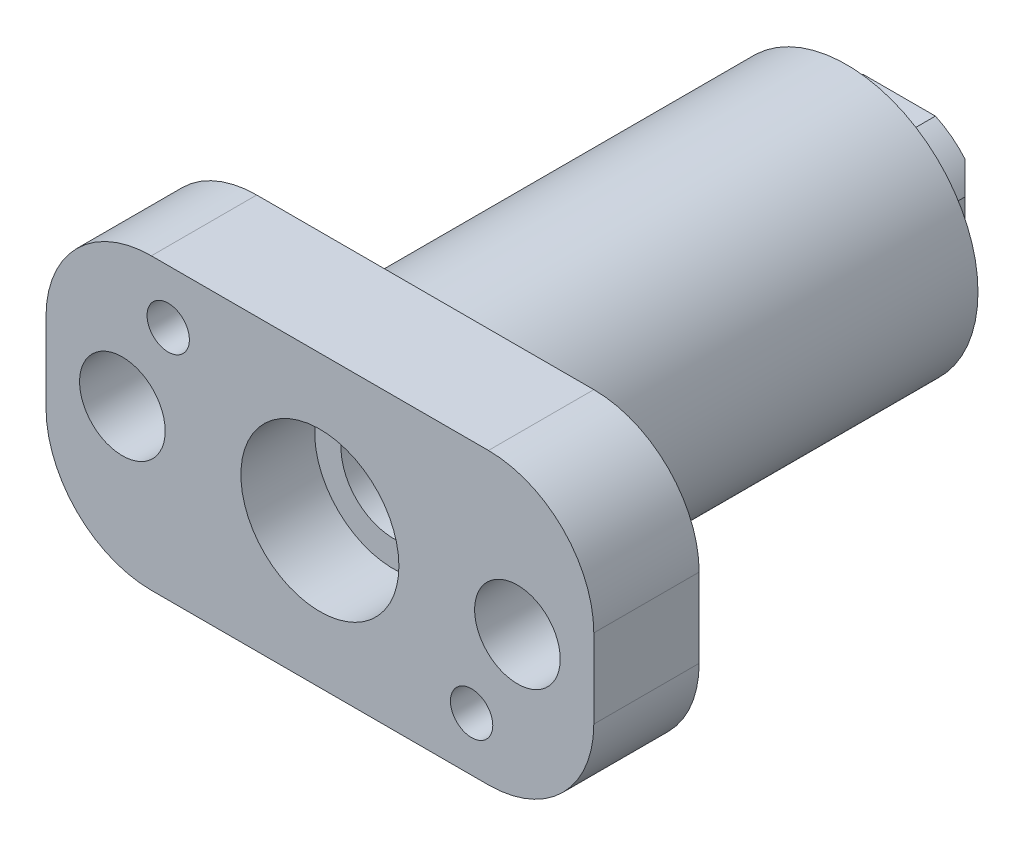
ISO-10303-21;
HEADER;
FILE_DESCRIPTION(('STEP AP214'),'2;1');
FILE_NAME('part.step','',(''),(''),'','','');
FILE_SCHEMA(('AUTOMOTIVE_DESIGN { 1 0 10303 214 1 1 1 1 }'));
ENDSEC;
DATA;
#1=APPLICATION_CONTEXT('core data for automotive mechanical design processes');
#2=APPLICATION_PROTOCOL_DEFINITION('international standard','automotive_design',2000,#1);
#3=PRODUCT_CONTEXT('',#1,'mechanical');
#4=PRODUCT('Part','Part','',(#3));
#5=PRODUCT_RELATED_PRODUCT_CATEGORY('part','',(#4));
#6=PRODUCT_DEFINITION_FORMATION('','',#4);
#7=PRODUCT_DEFINITION_CONTEXT('part definition',#1,'design');
#8=PRODUCT_DEFINITION('design','',#6,#7);
#9=PRODUCT_DEFINITION_SHAPE('','',#8);
#10=(LENGTH_UNIT() NAMED_UNIT(*) SI_UNIT(.MILLI.,.METRE.));
#11=(NAMED_UNIT(*) PLANE_ANGLE_UNIT() SI_UNIT($,.RADIAN.));
#12=(NAMED_UNIT(*) SI_UNIT($,.STERADIAN.) SOLID_ANGLE_UNIT());
#13=UNCERTAINTY_MEASURE_WITH_UNIT(LENGTH_MEASURE(1.E-05),#10,'distance_accuracy_value','');
#14=(GEOMETRIC_REPRESENTATION_CONTEXT(3) GLOBAL_UNCERTAINTY_ASSIGNED_CONTEXT((#13)) GLOBAL_UNIT_ASSIGNED_CONTEXT((#10,
#11,#12)) REPRESENTATION_CONTEXT('',''));
#15=CARTESIAN_POINT('',(0.,0.,0.));
#16=DIRECTION('',(0.,0.,1.));
#17=DIRECTION('',(1.,0.,0.));
#18=AXIS2_PLACEMENT_3D('',#15,#16,#17);
#19=CARTESIAN_POINT('',(9.4615,0.,-31.75));
#20=DIRECTION('',(0.,0.,-1.));
#21=DIRECTION('',(-1.,0.,0.));
#22=AXIS2_PLACEMENT_3D('',#19,#20,#21);
#23=PLANE('',#22);
#24=CARTESIAN_POINT('',(0.,0.,-31.75));
#25=DIRECTION('',(0.,0.,1.));
#26=DIRECTION('',(1.,0.,0.));
#27=AXIS2_PLACEMENT_3D('',#24,#25,#26);
#28=CIRCLE('',#27,6.35);
#29=CARTESIAN_POINT('',(6.35,0.,-31.75));
#30=VERTEX_POINT('',#29);
#31=EDGE_CURVE('E329',#30,#30,#28,.T.);
#32=ORIENTED_EDGE('',*,*,#31,.T.);
#33=EDGE_LOOP('',(#32));
#34=FACE_BOUND('',#33,.T.);
#35=CARTESIAN_POINT('',(0.,0.,-31.75));
#36=DIRECTION('',(0.,0.,-1.));
#37=DIRECTION('',(-1.,0.,0.));
#38=AXIS2_PLACEMENT_3D('',#35,#36,#37);
#39=CIRCLE('',#38,10.414);
#40=CARTESIAN_POINT('',(-4.35102444833397,-9.4615,-31.75));
#41=VERTEX_POINT('',#40);
#42=CARTESIAN_POINT('',(-7.93750000000002,-6.74147533927104,-31.75));
#43=VERTEX_POINT('',#42);
#44=EDGE_CURVE('E292',#41,#43,#39,.T.);
#45=ORIENTED_EDGE('',*,*,#44,.T.);
#46=DIRECTION('',(0.,1.,0.));
#47=VECTOR('',#46,1.);
#48=CARTESIAN_POINT('',(-7.93750000000002,4.35102444833397,-31.75));
#49=LINE('',#48,#47);
#50=CARTESIAN_POINT('',(-7.93750000000002,6.74147533927104,-31.75));
#51=VERTEX_POINT('',#50);
#52=EDGE_CURVE('E283',#43,#51,#49,.T.);
#53=ORIENTED_EDGE('',*,*,#52,.T.);
#54=CARTESIAN_POINT('',(-4.35102444833398,9.4615,-31.75));
#55=VERTEX_POINT('',#54);
#56=EDGE_CURVE('E304',#51,#55,#39,.T.);
#57=ORIENTED_EDGE('',*,*,#56,.T.);
#58=DIRECTION('',(1.,0.,0.));
#59=VECTOR('',#58,1.);
#60=CARTESIAN_POINT('',(9.4615,9.4615,-31.75));
#61=LINE('',#60,#59);
#62=CARTESIAN_POINT('',(4.35102444833398,9.4615,-31.75));
#63=VERTEX_POINT('',#62);
#64=EDGE_CURVE('E318',#55,#63,#61,.T.);
#65=ORIENTED_EDGE('',*,*,#64,.T.);
#66=CARTESIAN_POINT('',(7.93750000000002,6.74147533927105,-31.75));
#67=VERTEX_POINT('',#66);
#68=EDGE_CURVE('E303',#63,#67,#39,.T.);
#69=ORIENTED_EDGE('',*,*,#68,.T.);
#70=DIRECTION('',(0.,-1.,0.));
#71=VECTOR('',#70,1.);
#72=CARTESIAN_POINT('',(7.93750000000001,-4.35102444833398,-31.75));
#73=LINE('',#72,#71);
#74=CARTESIAN_POINT('',(7.93750000000002,-6.74147533927105,-31.75));
#75=VERTEX_POINT('',#74);
#76=EDGE_CURVE('E280',#67,#75,#73,.T.);
#77=ORIENTED_EDGE('',*,*,#76,.T.);
#78=CARTESIAN_POINT('',(4.35102444833397,-9.4615,-31.75));
#79=VERTEX_POINT('',#78);
#80=EDGE_CURVE('E300',#75,#79,#39,.T.);
#81=ORIENTED_EDGE('',*,*,#80,.T.);
#82=DIRECTION('',(-1.,0.,0.));
#83=VECTOR('',#82,1.);
#84=CARTESIAN_POINT('',(9.4615,-9.4615,-31.75));
#85=LINE('',#84,#83);
#86=EDGE_CURVE('E299',#79,#41,#85,.T.);
#87=ORIENTED_EDGE('',*,*,#86,.T.);
#88=EDGE_LOOP('',(#45,#53,#57,#65,#69,#77,#81,#87));
#89=FACE_BOUND('',#88,.T.);
#90=ADVANCED_FACE('F79',(#34,#89),#23,.T.);
#91=CARTESIAN_POINT('',(9.4615,9.4615,-58.5111632407861));
#92=DIRECTION('',(0.,-1.,0.));
#93=DIRECTION('',(0.,0.,-1.));
#94=AXIS2_PLACEMENT_3D('',#91,#92,#93);
#95=PLANE('',#94);
#96=DIRECTION('',(0.,0.,-1.));
#97=VECTOR('',#96,1.);
#98=CARTESIAN_POINT('',(-4.35102444833398,9.4615,50.05340332432));
#99=LINE('',#98,#97);
#100=CARTESIAN_POINT('',(-4.35102444833398,9.4615,-25.4));
#101=VERTEX_POINT('',#100);
#102=EDGE_CURVE('E316',#101,#55,#99,.T.);
#103=ORIENTED_EDGE('',*,*,#102,.F.);
#104=DIRECTION('',(-1.,0.,0.));
#105=VECTOR('',#104,1.);
#106=CARTESIAN_POINT('',(9.4615,9.4615,-25.4));
#107=LINE('',#106,#105);
#108=CARTESIAN_POINT('',(4.35102444833398,9.4615,-25.4));
#109=VERTEX_POINT('',#108);
#110=EDGE_CURVE('E232',#109,#101,#107,.T.);
#111=ORIENTED_EDGE('',*,*,#110,.F.);
#112=DIRECTION('',(0.,0.,-1.));
#113=VECTOR('',#112,1.);
#114=CARTESIAN_POINT('',(4.35102444833398,9.4615,50.05340332432));
#115=LINE('',#114,#113);
#116=EDGE_CURVE('E224',#63,#109,#115,.F.);
#117=ORIENTED_EDGE('',*,*,#116,.F.);
#118=ORIENTED_EDGE('',*,*,#64,.F.);
#119=EDGE_LOOP('',(#103,#111,#117,#118));
#120=FACE_BOUND('',#119,.T.);
#121=ADVANCED_FACE('F382',(#120),#95,.F.);
#122=CARTESIAN_POINT('',(-9.4615,9.4615,-58.5111632407861));
#123=DIRECTION('',(1.,0.,0.));
#124=DIRECTION('',(0.,1.,0.));
#125=AXIS2_PLACEMENT_3D('',#122,#123,#124);
#126=PLANE('',#125);
#127=DIRECTION('',(0.,0.,-1.));
#128=VECTOR('',#127,1.);
#129=CARTESIAN_POINT('',(-9.4615,4.35102444833397,50.05340332432));
#130=LINE('',#129,#128);
#131=CARTESIAN_POINT('',(-9.4615,4.35102444833397,-30.226));
#132=VERTEX_POINT('',#131);
#133=CARTESIAN_POINT('',(-9.4615,4.35102444833397,-25.4));
#134=VERTEX_POINT('',#133);
#135=EDGE_CURVE('E225',#132,#134,#130,.F.);
#136=ORIENTED_EDGE('',*,*,#135,.F.);
#137=DIRECTION('',(0.,-1.,0.));
#138=VECTOR('',#137,1.);
#139=CARTESIAN_POINT('',(-9.46150000000001,-4.35102444833397,-30.226));
#140=LINE('',#139,#138);
#141=CARTESIAN_POINT('',(-9.4615,-4.35102444833397,-30.226));
#142=VERTEX_POINT('',#141);
#143=EDGE_CURVE('E223',#132,#142,#140,.T.);
#144=ORIENTED_EDGE('',*,*,#143,.T.);
#145=DIRECTION('',(0.,0.,-1.));
#146=VECTOR('',#145,1.);
#147=CARTESIAN_POINT('',(-9.4615,-4.35102444833397,50.05340332432));
#148=LINE('',#147,#146);
#149=CARTESIAN_POINT('',(-9.4615,-4.35102444833397,-25.4));
#150=VERTEX_POINT('',#149);
#151=EDGE_CURVE('E206',#150,#142,#148,.T.);
#152=ORIENTED_EDGE('',*,*,#151,.F.);
#153=DIRECTION('',(0.,-1.,0.));
#154=VECTOR('',#153,1.);
#155=CARTESIAN_POINT('',(-9.4615,0.,-25.4));
#156=LINE('',#155,#154);
#157=EDGE_CURVE('E221',#134,#150,#156,.T.);
#158=ORIENTED_EDGE('',*,*,#157,.F.);
#159=EDGE_LOOP('',(#136,#144,#152,#158));
#160=FACE_BOUND('',#159,.T.);
#161=ADVANCED_FACE('F220',(#160),#126,.F.);
#162=CARTESIAN_POINT('',(9.4615,-9.4615,-58.5111632407861));
#163=DIRECTION('',(0.,1.,0.));
#164=DIRECTION('',(-1.,0.,0.));
#165=AXIS2_PLACEMENT_3D('',#162,#163,#164);
#166=PLANE('',#165);
#167=DIRECTION('',(0.,0.,-1.));
#168=VECTOR('',#167,1.);
#169=CARTESIAN_POINT('',(4.35102444833397,-9.4615,50.05340332432));
#170=LINE('',#169,#168);
#171=CARTESIAN_POINT('',(4.35102444833397,-9.4615,-25.4));
#172=VERTEX_POINT('',#171);
#173=EDGE_CURVE('E309',#172,#79,#170,.T.);
#174=ORIENTED_EDGE('',*,*,#173,.F.);
#175=DIRECTION('',(1.,0.,0.));
#176=VECTOR('',#175,1.);
#177=CARTESIAN_POINT('',(9.4615,-9.4615,-25.4));
#178=LINE('',#177,#176);
#179=CARTESIAN_POINT('',(-4.35102444833397,-9.4615,-25.4));
#180=VERTEX_POINT('',#179);
#181=EDGE_CURVE('E233',#180,#172,#178,.T.);
#182=ORIENTED_EDGE('',*,*,#181,.F.);
#183=DIRECTION('',(0.,0.,-1.));
#184=VECTOR('',#183,1.);
#185=CARTESIAN_POINT('',(-4.35102444833397,-9.4615,50.05340332432));
#186=LINE('',#185,#184);
#187=EDGE_CURVE('E209',#41,#180,#186,.F.);
#188=ORIENTED_EDGE('',*,*,#187,.F.);
#189=ORIENTED_EDGE('',*,*,#86,.F.);
#190=EDGE_LOOP('',(#174,#182,#188,#189));
#191=FACE_BOUND('',#190,.T.);
#192=ADVANCED_FACE('F389',(#191),#166,.F.);
#193=CARTESIAN_POINT('',(9.4615,9.4615,-58.5111632407861));
#194=DIRECTION('',(-1.,0.,0.));
#195=DIRECTION('',(0.,-1.,0.));
#196=AXIS2_PLACEMENT_3D('',#193,#194,#195);
#197=PLANE('',#196);
#198=DIRECTION('',(0.,0.,-1.));
#199=VECTOR('',#198,1.);
#200=CARTESIAN_POINT('',(9.4615,-4.35102444833398,50.05340332432));
#201=LINE('',#200,#199);
#202=CARTESIAN_POINT('',(9.4615,-4.35102444833398,-30.226));
#203=VERTEX_POINT('',#202);
#204=CARTESIAN_POINT('',(9.4615,-4.35102444833398,-25.4));
#205=VERTEX_POINT('',#204);
#206=EDGE_CURVE('E235',#203,#205,#201,.F.);
#207=ORIENTED_EDGE('',*,*,#206,.F.);
#208=DIRECTION('',(0.,1.,0.));
#209=VECTOR('',#208,1.);
#210=CARTESIAN_POINT('',(9.4615,4.35102444833398,-30.226));
#211=LINE('',#210,#209);
#212=CARTESIAN_POINT('',(9.4615,4.35102444833398,-30.226));
#213=VERTEX_POINT('',#212);
#214=EDGE_CURVE('E87',#203,#213,#211,.T.);
#215=ORIENTED_EDGE('',*,*,#214,.T.);
#216=DIRECTION('',(0.,0.,-1.));
#217=VECTOR('',#216,1.);
#218=CARTESIAN_POINT('',(9.4615,4.35102444833398,50.05340332432));
#219=LINE('',#218,#217);
#220=CARTESIAN_POINT('',(9.4615,4.35102444833398,-25.4));
#221=VERTEX_POINT('',#220);
#222=EDGE_CURVE('E242',#221,#213,#219,.T.);
#223=ORIENTED_EDGE('',*,*,#222,.F.);
#224=DIRECTION('',(0.,1.,0.));
#225=VECTOR('',#224,1.);
#226=CARTESIAN_POINT('',(9.4615,0.,-25.4));
#227=LINE('',#226,#225);
#228=EDGE_CURVE('E237',#205,#221,#227,.T.);
#229=ORIENTED_EDGE('',*,*,#228,.F.);
#230=EDGE_LOOP('',(#207,#215,#223,#229));
#231=FACE_BOUND('',#230,.T.);
#232=ADVANCED_FACE('F368',(#231),#197,.F.);
#233=CARTESIAN_POINT('',(9.4615,0.,-25.4));
#234=DIRECTION('',(0.,0.,-1.));
#235=DIRECTION('',(-1.,0.,0.));
#236=AXIS2_PLACEMENT_3D('',#233,#234,#235);
#237=PLANE('',#236);
#238=CARTESIAN_POINT('',(0.,0.,-25.4));
#239=DIRECTION('',(0.,0.,-1.));
#240=DIRECTION('',(-1.,0.,0.));
#241=AXIS2_PLACEMENT_3D('',#238,#239,#240);
#242=CIRCLE('',#241,10.414);
#243=EDGE_CURVE('E366',#221,#109,#242,.F.);
#244=ORIENTED_EDGE('',*,*,#243,.T.);
#245=ORIENTED_EDGE('',*,*,#110,.T.);
#246=EDGE_CURVE('E216',#101,#134,#242,.F.);
#247=ORIENTED_EDGE('',*,*,#246,.T.);
#248=ORIENTED_EDGE('',*,*,#157,.T.);
#249=EDGE_CURVE('E203',#150,#180,#242,.F.);
#250=ORIENTED_EDGE('',*,*,#249,.T.);
#251=ORIENTED_EDGE('',*,*,#181,.T.);
#252=EDGE_CURVE('E214',#172,#205,#242,.F.);
#253=ORIENTED_EDGE('',*,*,#252,.T.);
#254=ORIENTED_EDGE('',*,*,#228,.T.);
#255=EDGE_LOOP('',(#244,#245,#247,#248,#250,#251,#253,#254));
#256=FACE_BOUND('',#255,.T.);
#257=CARTESIAN_POINT('',(0.,0.,-25.4));
#258=DIRECTION('',(0.,0.,1.));
#259=DIRECTION('',(1.,0.,0.));
#260=AXIS2_PLACEMENT_3D('',#257,#258,#259);
#261=CIRCLE('',#260,15.8369);
#262=CARTESIAN_POINT('',(15.8369,0.,-25.4));
#263=VERTEX_POINT('',#262);
#264=EDGE_CURVE('E332',#263,#263,#261,.T.);
#265=ORIENTED_EDGE('',*,*,#264,.F.);
#266=EDGE_LOOP('',(#265));
#267=FACE_BOUND('',#266,.T.);
#268=ADVANCED_FACE('F229',(#256,#267),#237,.T.);
#269=CARTESIAN_POINT('',(0.,0.,-31.75));
#270=DIRECTION('',(0.,0.,1.));
#271=DIRECTION('',(1.,0.,0.));
#272=AXIS2_PLACEMENT_3D('',#269,#270,#271);
#273=CYLINDRICAL_SURFACE('',#272,6.35);
#274=ORIENTED_EDGE('',*,*,#31,.F.);
#275=EDGE_LOOP('',(#274));
#276=FACE_BOUND('',#275,.T.);
#277=CARTESIAN_POINT('',(0.,0.,29.21));
#278=DIRECTION('',(0.,0.,1.));
#279=DIRECTION('',(1.,0.,0.));
#280=AXIS2_PLACEMENT_3D('',#277,#278,#279);
#281=CIRCLE('',#280,6.35);
#282=CARTESIAN_POINT('',(6.35,0.,29.21));
#283=VERTEX_POINT('',#282);
#284=EDGE_CURVE('E326',#283,#283,#281,.F.);
#285=ORIENTED_EDGE('',*,*,#284,.F.);
#286=EDGE_LOOP('',(#285));
#287=FACE_BOUND('',#286,.T.);
#288=ADVANCED_FACE('F410',(#276,#287),#273,.F.);
#289=CARTESIAN_POINT('',(0.,0.,25.4));
#290=DIRECTION('',(0.,0.,-1.));
#291=DIRECTION('',(-1.,0.,0.));
#292=AXIS2_PLACEMENT_3D('',#289,#290,#291);
#293=CYLINDRICAL_SURFACE('',#292,15.8369);
#294=CARTESIAN_POINT('',(0.,0.,25.4));
#295=DIRECTION('',(0.,0.,1.));
#296=DIRECTION('',(1.,0.,0.));
#297=AXIS2_PLACEMENT_3D('',#294,#295,#296);
#298=CIRCLE('',#297,15.8369);
#299=CARTESIAN_POINT('',(15.8369,0.,25.4));
#300=VERTEX_POINT('',#299);
#301=EDGE_CURVE('E349',#300,#300,#298,.T.);
#302=ORIENTED_EDGE('',*,*,#301,.F.);
#303=EDGE_LOOP('',(#302));
#304=FACE_BOUND('',#303,.T.);
#305=ORIENTED_EDGE('',*,*,#264,.T.);
#306=EDGE_LOOP('',(#305));
#307=FACE_BOUND('',#306,.T.);
#308=ADVANCED_FACE('F413',(#304,#307),#293,.T.);
#309=CARTESIAN_POINT('',(-33.02,-17.4625,25.4));
#310=DIRECTION('',(0.,0.,-1.));
#311=DIRECTION('',(-1.,0.,0.));
#312=AXIS2_PLACEMENT_3D('',#309,#310,#311);
#313=PLANE('',#312);
#314=CARTESIAN_POINT('',(-23.8125,0.,25.4));
#315=DIRECTION('',(0.,0.,-1.));
#316=DIRECTION('',(-1.,0.,0.));
#317=AXIS2_PLACEMENT_3D('',#314,#315,#316);
#318=CIRCLE('',#317,5.15937499999998);
#319=CARTESIAN_POINT('',(-28.971875,0.,25.4));
#320=VERTEX_POINT('',#319);
#321=EDGE_CURVE('E504',#320,#320,#318,.T.);
#322=ORIENTED_EDGE('',*,*,#321,.F.);
#323=EDGE_LOOP('',(#322));
#324=FACE_BOUND('',#323,.T.);
#325=CARTESIAN_POINT('',(23.8125,0.,25.4));
#326=DIRECTION('',(0.,0.,-1.));
#327=DIRECTION('',(-1.,0.,0.));
#328=AXIS2_PLACEMENT_3D('',#325,#326,#327);
#329=CIRCLE('',#328,5.15937499999998);
#330=CARTESIAN_POINT('',(18.653125,0.,25.4));
#331=VERTEX_POINT('',#330);
#332=EDGE_CURVE('E498',#331,#331,#329,.T.);
#333=ORIENTED_EDGE('',*,*,#332,.F.);
#334=EDGE_LOOP('',(#333));
#335=FACE_BOUND('',#334,.T.);
#336=CARTESIAN_POINT('',(18.288,-10.9855,25.4));
#337=DIRECTION('',(0.,0.,-1.));
#338=DIRECTION('',(-1.,0.,0.));
#339=AXIS2_PLACEMENT_3D('',#336,#337,#338);
#340=CIRCLE('',#339,2.55269999999999);
#341=CARTESIAN_POINT('',(15.7353,-10.9855,25.4));
#342=VERTEX_POINT('',#341);
#343=EDGE_CURVE('E490',#342,#342,#340,.T.);
#344=ORIENTED_EDGE('',*,*,#343,.F.);
#345=EDGE_LOOP('',(#344));
#346=FACE_BOUND('',#345,.T.);
#347=CARTESIAN_POINT('',(-18.288,10.9855,25.4));
#348=DIRECTION('',(0.,0.,-1.));
#349=DIRECTION('',(-1.,0.,0.));
#350=AXIS2_PLACEMENT_3D('',#347,#348,#349);
#351=CIRCLE('',#350,2.55269999999999);
#352=CARTESIAN_POINT('',(-20.8407,10.9855,25.4));
#353=VERTEX_POINT('',#352);
#354=EDGE_CURVE('E301',#353,#353,#351,.T.);
#355=ORIENTED_EDGE('',*,*,#354,.F.);
#356=EDGE_LOOP('',(#355));
#357=FACE_BOUND('',#356,.T.);
#358=DIRECTION('',(0.,1.,0.));
#359=VECTOR('',#358,1.);
#360=CARTESIAN_POINT('',(33.02,17.4625,25.4));
#361=LINE('',#360,#359);
#362=CARTESIAN_POINT('',(33.02,-4.76250000000001,25.4));
#363=VERTEX_POINT('',#362);
#364=CARTESIAN_POINT('',(33.02,4.76250000000001,25.4));
#365=VERTEX_POINT('',#364);
#366=EDGE_CURVE('E355',#363,#365,#361,.T.);
#367=ORIENTED_EDGE('',*,*,#366,.F.);
#368=CARTESIAN_POINT('',(20.32,-4.76250000000001,25.4));
#369=DIRECTION('',(0.,0.,-1.));
#370=DIRECTION('',(-1.,0.,0.));
#371=AXIS2_PLACEMENT_3D('',#368,#369,#370);
#372=CIRCLE('',#371,12.7);
#373=CARTESIAN_POINT('',(20.32,-17.4625,25.4));
#374=VERTEX_POINT('',#373);
#375=EDGE_CURVE('E255',#363,#374,#372,.T.);
#376=ORIENTED_EDGE('',*,*,#375,.T.);
#377=DIRECTION('',(1.,0.,0.));
#378=VECTOR('',#377,1.);
#379=CARTESIAN_POINT('',(33.02,-17.4625,25.4));
#380=LINE('',#379,#378);
#381=CARTESIAN_POINT('',(-20.32,-17.4625,25.4));
#382=VERTEX_POINT('',#381);
#383=EDGE_CURVE('E352',#382,#374,#380,.T.);
#384=ORIENTED_EDGE('',*,*,#383,.F.);
#385=CARTESIAN_POINT('',(-20.32,-4.76250000000001,25.4));
#386=DIRECTION('',(0.,0.,-1.));
#387=DIRECTION('',(-1.,0.,0.));
#388=AXIS2_PLACEMENT_3D('',#385,#386,#387);
#389=CIRCLE('',#388,12.7);
#390=CARTESIAN_POINT('',(-33.02,-4.76250000000001,25.4));
#391=VERTEX_POINT('',#390);
#392=EDGE_CURVE('E249',#382,#391,#389,.T.);
#393=ORIENTED_EDGE('',*,*,#392,.T.);
#394=DIRECTION('',(0.,-1.,0.));
#395=VECTOR('',#394,1.);
#396=CARTESIAN_POINT('',(-33.02,17.4625,25.4));
#397=LINE('',#396,#395);
#398=CARTESIAN_POINT('',(-33.02,4.76250000000001,25.4));
#399=VERTEX_POINT('',#398);
#400=EDGE_CURVE('E335',#399,#391,#397,.T.);
#401=ORIENTED_EDGE('',*,*,#400,.F.);
#402=CARTESIAN_POINT('',(-20.32,4.76250000000001,25.4));
#403=DIRECTION('',(0.,0.,-1.));
#404=DIRECTION('',(-1.,0.,0.));
#405=AXIS2_PLACEMENT_3D('',#402,#403,#404);
#406=CIRCLE('',#405,12.7);
#407=CARTESIAN_POINT('',(-20.32,17.4625,25.4));
#408=VERTEX_POINT('',#407);
#409=EDGE_CURVE('E251',#399,#408,#406,.T.);
#410=ORIENTED_EDGE('',*,*,#409,.T.);
#411=DIRECTION('',(-1.,0.,0.));
#412=VECTOR('',#411,1.);
#413=CARTESIAN_POINT('',(-33.02,17.4625,25.4));
#414=LINE('',#413,#412);
#415=CARTESIAN_POINT('',(20.32,17.4625,25.4));
#416=VERTEX_POINT('',#415);
#417=EDGE_CURVE('E340',#416,#408,#414,.T.);
#418=ORIENTED_EDGE('',*,*,#417,.F.);
#419=CARTESIAN_POINT('',(20.32,4.76250000000001,25.4));
#420=DIRECTION('',(0.,0.,-1.));
#421=DIRECTION('',(-1.,0.,0.));
#422=AXIS2_PLACEMENT_3D('',#419,#420,#421);
#423=CIRCLE('',#422,12.7);
#424=EDGE_CURVE('E253',#416,#365,#423,.T.);
#425=ORIENTED_EDGE('',*,*,#424,.T.);
#426=EDGE_LOOP('',(#367,#376,#384,#393,#401,#410,#418,#425));
#427=FACE_BOUND('',#426,.T.);
#428=ORIENTED_EDGE('',*,*,#301,.T.);
#429=EDGE_LOOP('',(#428));
#430=FACE_BOUND('',#429,.T.);
#431=ADVANCED_FACE('F421',(#324,#335,#346,#357,#427,#430),#313,.T.);
#432=CARTESIAN_POINT('',(-33.02,17.4625,38.1));
#433=DIRECTION('',(1.,0.,0.));
#434=DIRECTION('',(0.,0.,-1.));
#435=AXIS2_PLACEMENT_3D('',#432,#433,#434);
#436=PLANE('',#435);
#437=DIRECTION('',(0.,-1.,0.));
#438=VECTOR('',#437,1.);
#439=CARTESIAN_POINT('',(-33.02,17.4625,38.1));
#440=LINE('',#439,#438);
#441=CARTESIAN_POINT('',(-33.02,4.76250000000001,38.1));
#442=VERTEX_POINT('',#441);
#443=CARTESIAN_POINT('',(-33.02,-4.76250000000001,38.1));
#444=VERTEX_POINT('',#443);
#445=EDGE_CURVE('E336',#442,#444,#440,.T.);
#446=ORIENTED_EDGE('',*,*,#445,.F.);
#447=DIRECTION('',(0.,0.,-1.));
#448=VECTOR('',#447,1.);
#449=CARTESIAN_POINT('',(-33.02,4.76250000000001,38.1));
#450=LINE('',#449,#448);
#451=EDGE_CURVE('E277',#442,#399,#450,.T.);
#452=ORIENTED_EDGE('',*,*,#451,.T.);
#453=ORIENTED_EDGE('',*,*,#400,.T.);
#454=DIRECTION('',(0.,0.,-1.));
#455=VECTOR('',#454,1.);
#456=CARTESIAN_POINT('',(-33.02,-4.76250000000001,38.1));
#457=LINE('',#456,#455);
#458=EDGE_CURVE('E275',#391,#444,#457,.F.);
#459=ORIENTED_EDGE('',*,*,#458,.T.);
#460=EDGE_LOOP('',(#446,#452,#453,#459));
#461=FACE_BOUND('',#460,.T.);
#462=ADVANCED_FACE('F424',(#461),#436,.F.);
#463=CARTESIAN_POINT('',(33.02,-17.4625,38.1));
#464=DIRECTION('',(0.,1.,0.));
#465=DIRECTION('',(0.,0.,1.));
#466=AXIS2_PLACEMENT_3D('',#463,#464,#465);
#467=PLANE('',#466);
#468=ORIENTED_EDGE('',*,*,#383,.T.);
#469=DIRECTION('',(0.,0.,-1.));
#470=VECTOR('',#469,1.);
#471=CARTESIAN_POINT('',(20.32,-17.4625,38.1));
#472=LINE('',#471,#470);
#473=CARTESIAN_POINT('',(20.32,-17.4625,38.1));
#474=VERTEX_POINT('',#473);
#475=EDGE_CURVE('E260',#374,#474,#472,.F.);
#476=ORIENTED_EDGE('',*,*,#475,.T.);
#477=DIRECTION('',(1.,0.,0.));
#478=VECTOR('',#477,1.);
#479=CARTESIAN_POINT('',(33.02,-17.4625,38.1));
#480=LINE('',#479,#478);
#481=CARTESIAN_POINT('',(-20.32,-17.4625,38.1));
#482=VERTEX_POINT('',#481);
#483=EDGE_CURVE('E339',#482,#474,#480,.T.);
#484=ORIENTED_EDGE('',*,*,#483,.F.);
#485=DIRECTION('',(0.,0.,-1.));
#486=VECTOR('',#485,1.);
#487=CARTESIAN_POINT('',(-20.32,-17.4625,38.1));
#488=LINE('',#487,#486);
#489=EDGE_CURVE('E257',#482,#382,#488,.T.);
#490=ORIENTED_EDGE('',*,*,#489,.T.);
#491=EDGE_LOOP('',(#468,#476,#484,#490));
#492=FACE_BOUND('',#491,.T.);
#493=ADVANCED_FACE('F432',(#492),#467,.F.);
#494=CARTESIAN_POINT('',(33.02,17.4625,38.1));
#495=DIRECTION('',(-1.,0.,0.));
#496=DIRECTION('',(0.,0.,1.));
#497=AXIS2_PLACEMENT_3D('',#494,#495,#496);
#498=PLANE('',#497);
#499=DIRECTION('',(0.,1.,0.));
#500=VECTOR('',#499,1.);
#501=CARTESIAN_POINT('',(33.02,17.4625,38.1));
#502=LINE('',#501,#500);
#503=CARTESIAN_POINT('',(33.02,-4.76250000000001,38.1));
#504=VERTEX_POINT('',#503);
#505=CARTESIAN_POINT('',(33.02,4.76250000000001,38.1));
#506=VERTEX_POINT('',#505);
#507=EDGE_CURVE('E343',#504,#506,#502,.T.);
#508=ORIENTED_EDGE('',*,*,#507,.F.);
#509=DIRECTION('',(0.,0.,-1.));
#510=VECTOR('',#509,1.);
#511=CARTESIAN_POINT('',(33.02,-4.76250000000001,38.1));
#512=LINE('',#511,#510);
#513=EDGE_CURVE('E246',#504,#363,#512,.T.);
#514=ORIENTED_EDGE('',*,*,#513,.T.);
#515=ORIENTED_EDGE('',*,*,#366,.T.);
#516=DIRECTION('',(0.,0.,-1.));
#517=VECTOR('',#516,1.);
#518=CARTESIAN_POINT('',(33.02,4.76250000000001,38.1));
#519=LINE('',#518,#517);
#520=EDGE_CURVE('E244',#365,#506,#519,.F.);
#521=ORIENTED_EDGE('',*,*,#520,.T.);
#522=EDGE_LOOP('',(#508,#514,#515,#521));
#523=FACE_BOUND('',#522,.T.);
#524=ADVANCED_FACE('F428',(#523),#498,.F.);
#525=CARTESIAN_POINT('',(-33.02,17.4625,38.1));
#526=DIRECTION('',(0.,-1.,0.));
#527=DIRECTION('',(0.,0.,-1.));
#528=AXIS2_PLACEMENT_3D('',#525,#526,#527);
#529=PLANE('',#528);
#530=DIRECTION('',(-1.,0.,0.));
#531=VECTOR('',#530,1.);
#532=CARTESIAN_POINT('',(-33.02,17.4625,38.1));
#533=LINE('',#532,#531);
#534=CARTESIAN_POINT('',(20.32,17.4625,38.1));
#535=VERTEX_POINT('',#534);
#536=CARTESIAN_POINT('',(-20.32,17.4625,38.1));
#537=VERTEX_POINT('',#536);
#538=EDGE_CURVE('E346',#535,#537,#533,.T.);
#539=ORIENTED_EDGE('',*,*,#538,.F.);
#540=DIRECTION('',(0.,0.,-1.));
#541=VECTOR('',#540,1.);
#542=CARTESIAN_POINT('',(20.32,17.4625,38.1));
#543=LINE('',#542,#541);
#544=EDGE_CURVE('E272',#535,#416,#543,.T.);
#545=ORIENTED_EDGE('',*,*,#544,.T.);
#546=ORIENTED_EDGE('',*,*,#417,.T.);
#547=DIRECTION('',(0.,0.,-1.));
#548=VECTOR('',#547,1.);
#549=CARTESIAN_POINT('',(-20.32,17.4625,38.1));
#550=LINE('',#549,#548);
#551=EDGE_CURVE('E270',#408,#537,#550,.F.);
#552=ORIENTED_EDGE('',*,*,#551,.T.);
#553=EDGE_LOOP('',(#539,#545,#546,#552));
#554=FACE_BOUND('',#553,.T.);
#555=ADVANCED_FACE('F419',(#554),#529,.F.);
#556=CARTESIAN_POINT('',(-33.02,-17.4625,38.1));
#557=DIRECTION('',(0.,0.,-1.));
#558=DIRECTION('',(-1.,0.,0.));
#559=AXIS2_PLACEMENT_3D('',#556,#557,#558);
#560=PLANE('',#559);
#561=CARTESIAN_POINT('',(-23.8125,0.,38.1));
#562=DIRECTION('',(0.,0.,1.));
#563=DIRECTION('',(1.,0.,0.));
#564=AXIS2_PLACEMENT_3D('',#561,#562,#563);
#565=CIRCLE('',#564,5.15937499999999);
#566=CARTESIAN_POINT('',(-18.653125,0.,38.1));
#567=VERTEX_POINT('',#566);
#568=EDGE_CURVE('E506',#567,#567,#565,.T.);
#569=ORIENTED_EDGE('',*,*,#568,.F.);
#570=EDGE_LOOP('',(#569));
#571=FACE_BOUND('',#570,.T.);
#572=CARTESIAN_POINT('',(23.8125,0.,38.1));
#573=DIRECTION('',(0.,0.,1.));
#574=DIRECTION('',(1.,0.,0.));
#575=AXIS2_PLACEMENT_3D('',#572,#573,#574);
#576=CIRCLE('',#575,5.15937499999999);
#577=CARTESIAN_POINT('',(28.971875,0.,38.1));
#578=VERTEX_POINT('',#577);
#579=EDGE_CURVE('E501',#578,#578,#576,.T.);
#580=ORIENTED_EDGE('',*,*,#579,.F.);
#581=EDGE_LOOP('',(#580));
#582=FACE_BOUND('',#581,.T.);
#583=CARTESIAN_POINT('',(18.288,-10.9855,38.1));
#584=DIRECTION('',(0.,0.,1.));
#585=DIRECTION('',(1.,0.,0.));
#586=AXIS2_PLACEMENT_3D('',#583,#584,#585);
#587=CIRCLE('',#586,2.55269999999999);
#588=CARTESIAN_POINT('',(20.8407,-10.9855,38.1));
#589=VERTEX_POINT('',#588);
#590=EDGE_CURVE('E493',#589,#589,#587,.T.);
#591=ORIENTED_EDGE('',*,*,#590,.F.);
#592=EDGE_LOOP('',(#591));
#593=FACE_BOUND('',#592,.T.);
#594=CARTESIAN_POINT('',(-18.288,10.9855,38.1));
#595=DIRECTION('',(0.,0.,1.));
#596=DIRECTION('',(1.,0.,0.));
#597=AXIS2_PLACEMENT_3D('',#594,#595,#596);
#598=CIRCLE('',#597,2.55269999999999);
#599=CARTESIAN_POINT('',(-15.7353,10.9855,38.1));
#600=VERTEX_POINT('',#599);
#601=EDGE_CURVE('E488',#600,#600,#598,.T.);
#602=ORIENTED_EDGE('',*,*,#601,.F.);
#603=EDGE_LOOP('',(#602));
#604=FACE_BOUND('',#603,.T.);
#605=CARTESIAN_POINT('',(0.,0.,38.1));
#606=DIRECTION('',(0.,0.,1.));
#607=DIRECTION('',(1.,0.,0.));
#608=AXIS2_PLACEMENT_3D('',#605,#606,#607);
#609=CIRCLE('',#608,9.525);
#610=CARTESIAN_POINT('',(9.525,0.,38.1));
#611=VERTEX_POINT('',#610);
#612=EDGE_CURVE('E322',#611,#611,#609,.T.);
#613=ORIENTED_EDGE('',*,*,#612,.F.);
#614=EDGE_LOOP('',(#613));
#615=FACE_BOUND('',#614,.T.);
#616=ORIENTED_EDGE('',*,*,#483,.T.);
#617=CARTESIAN_POINT('',(20.32,-4.76250000000001,38.1));
#618=DIRECTION('',(0.,0.,-1.));
#619=DIRECTION('',(-1.,0.,0.));
#620=AXIS2_PLACEMENT_3D('',#617,#618,#619);
#621=CIRCLE('',#620,12.7);
#622=EDGE_CURVE('E268',#474,#504,#621,.F.);
#623=ORIENTED_EDGE('',*,*,#622,.T.);
#624=ORIENTED_EDGE('',*,*,#507,.T.);
#625=CARTESIAN_POINT('',(20.32,4.76250000000001,38.1));
#626=DIRECTION('',(0.,0.,-1.));
#627=DIRECTION('',(-1.,0.,0.));
#628=AXIS2_PLACEMENT_3D('',#625,#626,#627);
#629=CIRCLE('',#628,12.7);
#630=EDGE_CURVE('E266',#506,#535,#629,.F.);
#631=ORIENTED_EDGE('',*,*,#630,.T.);
#632=ORIENTED_EDGE('',*,*,#538,.T.);
#633=CARTESIAN_POINT('',(-20.32,4.76250000000001,38.1));
#634=DIRECTION('',(0.,0.,-1.));
#635=DIRECTION('',(-1.,0.,0.));
#636=AXIS2_PLACEMENT_3D('',#633,#634,#635);
#637=CIRCLE('',#636,12.7);
#638=EDGE_CURVE('E264',#537,#442,#637,.F.);
#639=ORIENTED_EDGE('',*,*,#638,.T.);
#640=ORIENTED_EDGE('',*,*,#445,.T.);
#641=CARTESIAN_POINT('',(-20.32,-4.76250000000001,38.1));
#642=DIRECTION('',(0.,0.,-1.));
#643=DIRECTION('',(-1.,0.,0.));
#644=AXIS2_PLACEMENT_3D('',#641,#642,#643);
#645=CIRCLE('',#644,12.7);
#646=EDGE_CURVE('E262',#444,#482,#645,.F.);
#647=ORIENTED_EDGE('',*,*,#646,.T.);
#648=EDGE_LOOP('',(#616,#623,#624,#631,#632,#639,#640,#647));
#649=FACE_BOUND('',#648,.T.);
#650=ADVANCED_FACE('F405',(#571,#582,#593,#604,#615,#649),#560,.F.);
#651=CARTESIAN_POINT('',(0.,0.,29.21));
#652=DIRECTION('',(0.,0.,1.));
#653=DIRECTION('',(1.,0.,0.));
#654=AXIS2_PLACEMENT_3D('',#651,#652,#653);
#655=PLANE('',#654);
#656=CARTESIAN_POINT('',(0.,0.,29.21));
#657=DIRECTION('',(0.,0.,1.));
#658=DIRECTION('',(1.,0.,0.));
#659=AXIS2_PLACEMENT_3D('',#656,#657,#658);
#660=CIRCLE('',#659,9.525);
#661=CARTESIAN_POINT('',(9.525,0.,29.21));
#662=VERTEX_POINT('',#661);
#663=EDGE_CURVE('E323',#662,#662,#660,.T.);
#664=ORIENTED_EDGE('',*,*,#663,.T.);
#665=EDGE_LOOP('',(#664));
#666=FACE_BOUND('',#665,.T.);
#667=ORIENTED_EDGE('',*,*,#284,.T.);
#668=EDGE_LOOP('',(#667));
#669=FACE_BOUND('',#668,.T.);
#670=ADVANCED_FACE('F401',(#666,#669),#655,.T.);
#671=CARTESIAN_POINT('',(0.,0.,29.21));
#672=DIRECTION('',(0.,0.,1.));
#673=DIRECTION('',(1.,0.,0.));
#674=AXIS2_PLACEMENT_3D('',#671,#672,#673);
#675=CYLINDRICAL_SURFACE('',#674,9.525);
#676=ORIENTED_EDGE('',*,*,#663,.F.);
#677=EDGE_LOOP('',(#676));
#678=FACE_BOUND('',#677,.T.);
#679=ORIENTED_EDGE('',*,*,#612,.T.);
#680=EDGE_LOOP('',(#679));
#681=FACE_BOUND('',#680,.T.);
#682=ADVANCED_FACE('F404',(#678,#681),#675,.F.);
#683=CARTESIAN_POINT('',(0.,0.,50.05340332432));
#684=DIRECTION('',(0.,0.,-1.));
#685=DIRECTION('',(-1.,0.,0.));
#686=AXIS2_PLACEMENT_3D('',#683,#684,#685);
#687=CYLINDRICAL_SURFACE('',#686,10.414);
#688=ORIENTED_EDGE('',*,*,#80,.F.);
#689=CARTESIAN_POINT('',(0.,0.,-39.6875000000001));
#690=DIRECTION('',(0.707106781186551,0.,-0.707106781186544));
#691=DIRECTION('',(-0.707106781186544,0.,-0.707106781186551));
#692=AXIS2_PLACEMENT_3D('',#689,#690,#691);
#693=ELLIPSE('',#692,14.7276200385535,10.414);
#694=EDGE_CURVE('E101',#75,#203,#693,.F.);
#695=ORIENTED_EDGE('',*,*,#694,.T.);
#696=ORIENTED_EDGE('',*,*,#206,.T.);
#697=ORIENTED_EDGE('',*,*,#252,.F.);
#698=ORIENTED_EDGE('',*,*,#173,.T.);
#699=EDGE_LOOP('',(#688,#695,#696,#697,#698));
#700=FACE_BOUND('',#699,.T.);
#701=ADVANCED_FACE('F375',(#700),#687,.T.);
#702=ORIENTED_EDGE('',*,*,#222,.T.);
#703=CARTESIAN_POINT('',(0.,0.,-39.6875000000001));
#704=DIRECTION('',(0.707106781186551,0.,-0.707106781186544));
#705=DIRECTION('',(-0.707106781186544,0.,-0.707106781186551));
#706=AXIS2_PLACEMENT_3D('',#703,#704,#705);
#707=ELLIPSE('',#706,14.7276200385535,10.414);
#708=EDGE_CURVE('E13',#213,#67,#707,.F.);
#709=ORIENTED_EDGE('',*,*,#708,.T.);
#710=ORIENTED_EDGE('',*,*,#68,.F.);
#711=ORIENTED_EDGE('',*,*,#116,.T.);
#712=ORIENTED_EDGE('',*,*,#243,.F.);
#713=EDGE_LOOP('',(#702,#709,#710,#711,#712));
#714=FACE_BOUND('',#713,.T.);
#715=ADVANCED_FACE('F371',(#714),#687,.T.);
#716=ORIENTED_EDGE('',*,*,#151,.T.);
#717=CARTESIAN_POINT('',(0.,0.,-39.6875000000001));
#718=DIRECTION('',(-0.70710678118655,0.,-0.707106781186545));
#719=DIRECTION('',(0.707106781186545,0.,-0.70710678118655));
#720=AXIS2_PLACEMENT_3D('',#717,#718,#719);
#721=ELLIPSE('',#720,14.7276200385535,10.414);
#722=EDGE_CURVE('E289',#142,#43,#721,.F.);
#723=ORIENTED_EDGE('',*,*,#722,.T.);
#724=ORIENTED_EDGE('',*,*,#44,.F.);
#725=ORIENTED_EDGE('',*,*,#187,.T.);
#726=ORIENTED_EDGE('',*,*,#249,.F.);
#727=EDGE_LOOP('',(#716,#723,#724,#725,#726));
#728=FACE_BOUND('',#727,.T.);
#729=ADVANCED_FACE('F205',(#728),#687,.T.);
#730=ORIENTED_EDGE('',*,*,#56,.F.);
#731=CARTESIAN_POINT('',(0.,0.,-39.6875000000001));
#732=DIRECTION('',(-0.70710678118655,0.,-0.707106781186545));
#733=DIRECTION('',(0.707106781186545,0.,-0.70710678118655));
#734=AXIS2_PLACEMENT_3D('',#731,#732,#733);
#735=ELLIPSE('',#734,14.7276200385535,10.414);
#736=EDGE_CURVE('E286',#51,#132,#735,.F.);
#737=ORIENTED_EDGE('',*,*,#736,.T.);
#738=ORIENTED_EDGE('',*,*,#135,.T.);
#739=ORIENTED_EDGE('',*,*,#246,.F.);
#740=ORIENTED_EDGE('',*,*,#102,.T.);
#741=EDGE_LOOP('',(#730,#737,#738,#739,#740));
#742=FACE_BOUND('',#741,.T.);
#743=ADVANCED_FACE('F307',(#742),#687,.T.);
#744=CARTESIAN_POINT('',(20.32,-4.76250000000001,38.1));
#745=DIRECTION('',(0.,0.,-1.));
#746=DIRECTION('',(-1.,0.,0.));
#747=AXIS2_PLACEMENT_3D('',#744,#745,#746);
#748=CYLINDRICAL_SURFACE('',#747,12.7);
#749=ORIENTED_EDGE('',*,*,#622,.F.);
#750=ORIENTED_EDGE('',*,*,#475,.F.);
#751=ORIENTED_EDGE('',*,*,#375,.F.);
#752=ORIENTED_EDGE('',*,*,#513,.F.);
#753=EDGE_LOOP('',(#749,#750,#751,#752));
#754=FACE_BOUND('',#753,.T.);
#755=ADVANCED_FACE('F443',(#754),#748,.T.);
#756=CARTESIAN_POINT('',(20.32,4.76250000000001,38.1));
#757=DIRECTION('',(0.,0.,-1.));
#758=DIRECTION('',(-1.,0.,0.));
#759=AXIS2_PLACEMENT_3D('',#756,#757,#758);
#760=CYLINDRICAL_SURFACE('',#759,12.7);
#761=ORIENTED_EDGE('',*,*,#630,.F.);
#762=ORIENTED_EDGE('',*,*,#520,.F.);
#763=ORIENTED_EDGE('',*,*,#424,.F.);
#764=ORIENTED_EDGE('',*,*,#544,.F.);
#765=EDGE_LOOP('',(#761,#762,#763,#764));
#766=FACE_BOUND('',#765,.T.);
#767=ADVANCED_FACE('F446',(#766),#760,.T.);
#768=CARTESIAN_POINT('',(-20.32,4.76250000000001,38.1));
#769=DIRECTION('',(0.,0.,-1.));
#770=DIRECTION('',(-1.,0.,0.));
#771=AXIS2_PLACEMENT_3D('',#768,#769,#770);
#772=CYLINDRICAL_SURFACE('',#771,12.7);
#773=ORIENTED_EDGE('',*,*,#638,.F.);
#774=ORIENTED_EDGE('',*,*,#551,.F.);
#775=ORIENTED_EDGE('',*,*,#409,.F.);
#776=ORIENTED_EDGE('',*,*,#451,.F.);
#777=EDGE_LOOP('',(#773,#774,#775,#776));
#778=FACE_BOUND('',#777,.T.);
#779=ADVANCED_FACE('F450',(#778),#772,.T.);
#780=CARTESIAN_POINT('',(-20.32,-4.76250000000001,38.1));
#781=DIRECTION('',(0.,0.,-1.));
#782=DIRECTION('',(-1.,0.,0.));
#783=AXIS2_PLACEMENT_3D('',#780,#781,#782);
#784=CYLINDRICAL_SURFACE('',#783,12.7);
#785=ORIENTED_EDGE('',*,*,#646,.F.);
#786=ORIENTED_EDGE('',*,*,#458,.F.);
#787=ORIENTED_EDGE('',*,*,#392,.F.);
#788=ORIENTED_EDGE('',*,*,#489,.F.);
#789=EDGE_LOOP('',(#785,#786,#787,#788));
#790=FACE_BOUND('',#789,.T.);
#791=ADVANCED_FACE('F454',(#790),#784,.T.);
#792=CARTESIAN_POINT('',(-18.288,10.9855,38.1));
#793=DIRECTION('',(0.,0.,1.));
#794=DIRECTION('',(1.,0.,0.));
#795=AXIS2_PLACEMENT_3D('',#792,#793,#794);
#796=CYLINDRICAL_SURFACE('',#795,2.55269999999999);
#797=ORIENTED_EDGE('',*,*,#354,.T.);
#798=EDGE_LOOP('',(#797));
#799=FACE_BOUND('',#798,.T.);
#800=ORIENTED_EDGE('',*,*,#601,.T.);
#801=EDGE_LOOP('',(#800));
#802=FACE_BOUND('',#801,.T.);
#803=ADVANCED_FACE('F457',(#799,#802),#796,.F.);
#804=CARTESIAN_POINT('',(18.288,-10.9855,38.1));
#805=DIRECTION('',(0.,0.,1.));
#806=DIRECTION('',(1.,0.,0.));
#807=AXIS2_PLACEMENT_3D('',#804,#805,#806);
#808=CYLINDRICAL_SURFACE('',#807,2.55269999999999);
#809=ORIENTED_EDGE('',*,*,#343,.T.);
#810=EDGE_LOOP('',(#809));
#811=FACE_BOUND('',#810,.T.);
#812=ORIENTED_EDGE('',*,*,#590,.T.);
#813=EDGE_LOOP('',(#812));
#814=FACE_BOUND('',#813,.T.);
#815=ADVANCED_FACE('F471',(#811,#814),#808,.F.);
#816=CARTESIAN_POINT('',(23.8125,0.,38.1));
#817=DIRECTION('',(0.,0.,1.));
#818=DIRECTION('',(1.,0.,0.));
#819=AXIS2_PLACEMENT_3D('',#816,#817,#818);
#820=CYLINDRICAL_SURFACE('',#819,5.15937499999998);
#821=ORIENTED_EDGE('',*,*,#332,.T.);
#822=EDGE_LOOP('',(#821));
#823=FACE_BOUND('',#822,.T.);
#824=ORIENTED_EDGE('',*,*,#579,.T.);
#825=EDGE_LOOP('',(#824));
#826=FACE_BOUND('',#825,.T.);
#827=ADVANCED_FACE('F465',(#823,#826),#820,.F.);
#828=CARTESIAN_POINT('',(-23.8125,0.,38.1));
#829=DIRECTION('',(0.,0.,1.));
#830=DIRECTION('',(1.,0.,0.));
#831=AXIS2_PLACEMENT_3D('',#828,#829,#830);
#832=CYLINDRICAL_SURFACE('',#831,5.15937499999998);
#833=ORIENTED_EDGE('',*,*,#321,.T.);
#834=EDGE_LOOP('',(#833));
#835=FACE_BOUND('',#834,.T.);
#836=ORIENTED_EDGE('',*,*,#568,.T.);
#837=EDGE_LOOP('',(#836));
#838=FACE_BOUND('',#837,.T.);
#839=ADVANCED_FACE('F460',(#835,#838),#832,.F.);
#840=CARTESIAN_POINT('',(-7.93750000000002,0.,-31.75));
#841=DIRECTION('',(-0.70710678118655,0.,-0.707106781186545));
#842=DIRECTION('',(-0.707106781186545,0.,0.70710678118655));
#843=AXIS2_PLACEMENT_3D('',#840,#841,#842);
#844=PLANE('',#843);
#845=ORIENTED_EDGE('',*,*,#722,.F.);
#846=ORIENTED_EDGE('',*,*,#143,.F.);
#847=ORIENTED_EDGE('',*,*,#736,.F.);
#848=ORIENTED_EDGE('',*,*,#52,.F.);
#849=EDGE_LOOP('',(#845,#846,#847,#848));
#850=FACE_BOUND('',#849,.T.);
#851=ADVANCED_FACE('F305',(#850),#844,.T.);
#852=CARTESIAN_POINT('',(7.93750000000001,0.,-31.75));
#853=DIRECTION('',(0.707106781186551,0.,-0.707106781186544));
#854=DIRECTION('',(-0.707106781186544,0.,-0.707106781186551));
#855=AXIS2_PLACEMENT_3D('',#852,#853,#854);
#856=PLANE('',#855);
#857=ORIENTED_EDGE('',*,*,#708,.F.);
#858=ORIENTED_EDGE('',*,*,#214,.F.);
#859=ORIENTED_EDGE('',*,*,#694,.F.);
#860=ORIENTED_EDGE('',*,*,#76,.F.);
#861=EDGE_LOOP('',(#857,#858,#859,#860));
#862=FACE_BOUND('',#861,.T.);
#863=ADVANCED_FACE('F81',(#862),#856,.T.);
#864=CLOSED_SHELL('',(#90,#121,#161,#192,#232,#268,#288,#308,#431,#462,#493,#524,#555,#650,#670,
#682,#701,#715,#729,#743,#755,#767,#779,#791,#803,#815,#827,#839,#851,#863));
#865=MANIFOLD_SOLID_BREP('B2',#864);
#866=ADVANCED_BREP_SHAPE_REPRESENTATION('',(#18,#865),#14);
#867=SHAPE_DEFINITION_REPRESENTATION(#9,#866);
ENDSEC;
END-ISO-10303-21;
